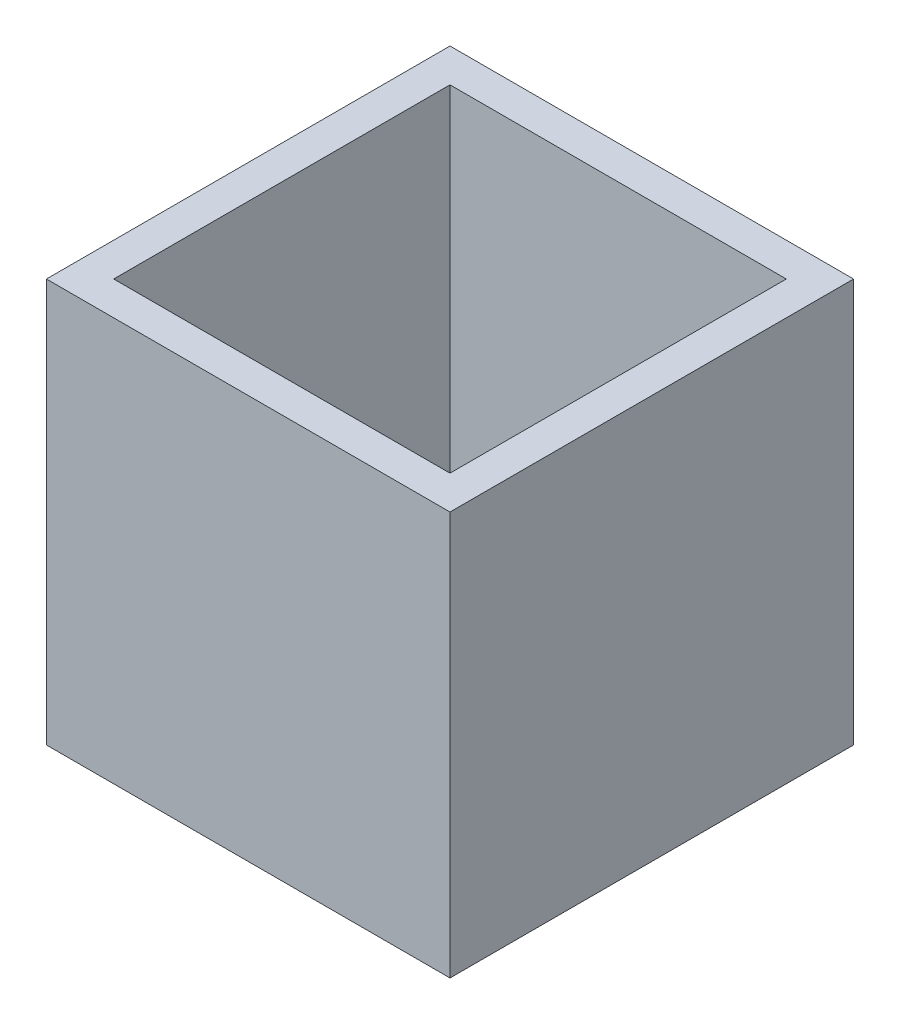
ISO-10303-21;
HEADER;
FILE_DESCRIPTION(('STEP AP214'),'2;1');
FILE_NAME('part.step','',(''),(''),'','','');
FILE_SCHEMA(('AUTOMOTIVE_DESIGN { 1 0 10303 214 1 1 1 1 }'));
ENDSEC;
DATA;
#1=APPLICATION_CONTEXT('core data for automotive mechanical design processes');
#2=APPLICATION_PROTOCOL_DEFINITION('international standard','automotive_design',2000,#1);
#3=PRODUCT_CONTEXT('',#1,'mechanical');
#4=PRODUCT('Part','Part','',(#3));
#5=PRODUCT_RELATED_PRODUCT_CATEGORY('part','',(#4));
#6=PRODUCT_DEFINITION_FORMATION('','',#4);
#7=PRODUCT_DEFINITION_CONTEXT('part definition',#1,'design');
#8=PRODUCT_DEFINITION('design','',#6,#7);
#9=PRODUCT_DEFINITION_SHAPE('','',#8);
#10=(LENGTH_UNIT() NAMED_UNIT(*) SI_UNIT(.MILLI.,.METRE.));
#11=(NAMED_UNIT(*) PLANE_ANGLE_UNIT() SI_UNIT($,.RADIAN.));
#12=(NAMED_UNIT(*) SI_UNIT($,.STERADIAN.) SOLID_ANGLE_UNIT());
#13=UNCERTAINTY_MEASURE_WITH_UNIT(LENGTH_MEASURE(1.E-05),#10,'distance_accuracy_value','');
#14=(GEOMETRIC_REPRESENTATION_CONTEXT(3) GLOBAL_UNCERTAINTY_ASSIGNED_CONTEXT((#13)) GLOBAL_UNIT_ASSIGNED_CONTEXT((#10,
#11,#12)) REPRESENTATION_CONTEXT('',''));
#15=CARTESIAN_POINT('',(0.,0.,0.));
#16=DIRECTION('',(0.,0.,1.));
#17=DIRECTION('',(1.,0.,0.));
#18=AXIS2_PLACEMENT_3D('',#15,#16,#17);
#19=CARTESIAN_POINT('',(150.,300.,-150.));
#20=DIRECTION('',(0.,-1.,0.));
#21=DIRECTION('',(0.,0.,-1.));
#22=AXIS2_PLACEMENT_3D('',#19,#20,#21);
#23=PLANE('',#22);
#24=DIRECTION('',(0.,0.,-1.));
#25=VECTOR('',#24,1.);
#26=CARTESIAN_POINT('',(150.,300.,150.));
#27=LINE('',#26,#25);
#28=CARTESIAN_POINT('',(150.,300.,150.));
#29=VERTEX_POINT('',#28);
#30=CARTESIAN_POINT('',(150.,300.,-150.));
#31=VERTEX_POINT('',#30);
#32=EDGE_CURVE('E142',#29,#31,#27,.T.);
#33=ORIENTED_EDGE('',*,*,#32,.T.);
#34=DIRECTION('',(-1.,0.,0.));
#35=VECTOR('',#34,1.);
#36=CARTESIAN_POINT('',(-150.,300.,-150.));
#37=LINE('',#36,#35);
#38=CARTESIAN_POINT('',(-150.,300.,-150.));
#39=VERTEX_POINT('',#38);
#40=EDGE_CURVE('E86',#31,#39,#37,.T.);
#41=ORIENTED_EDGE('',*,*,#40,.T.);
#42=DIRECTION('',(0.,0.,1.));
#43=VECTOR('',#42,1.);
#44=CARTESIAN_POINT('',(-150.,300.,150.));
#45=LINE('',#44,#43);
#46=CARTESIAN_POINT('',(-150.,300.,150.));
#47=VERTEX_POINT('',#46);
#48=EDGE_CURVE('E145',#39,#47,#45,.T.);
#49=ORIENTED_EDGE('',*,*,#48,.T.);
#50=DIRECTION('',(1.,0.,0.));
#51=VECTOR('',#50,1.);
#52=CARTESIAN_POINT('',(-150.,300.,150.));
#53=LINE('',#52,#51);
#54=EDGE_CURVE('E58',#47,#29,#53,.T.);
#55=ORIENTED_EDGE('',*,*,#54,.T.);
#56=EDGE_LOOP('',(#33,#41,#49,#55));
#57=FACE_BOUND('',#56,.T.);
#58=DIRECTION('',(0.,0.,-1.));
#59=VECTOR('',#58,1.);
#60=CARTESIAN_POINT('',(125.,300.,-150.));
#61=LINE('',#60,#59);
#62=CARTESIAN_POINT('',(125.,300.,125.));
#63=VERTEX_POINT('',#62);
#64=CARTESIAN_POINT('',(125.,300.,-125.));
#65=VERTEX_POINT('',#64);
#66=EDGE_CURVE('E131',#63,#65,#61,.T.);
#67=ORIENTED_EDGE('',*,*,#66,.F.);
#68=DIRECTION('',(1.,0.,0.));
#69=VECTOR('',#68,1.);
#70=CARTESIAN_POINT('',(150.,300.,125.));
#71=LINE('',#70,#69);
#72=CARTESIAN_POINT('',(-125.,300.,125.));
#73=VERTEX_POINT('',#72);
#74=EDGE_CURVE('E140',#73,#63,#71,.T.);
#75=ORIENTED_EDGE('',*,*,#74,.F.);
#76=DIRECTION('',(0.,0.,1.));
#77=VECTOR('',#76,1.);
#78=CARTESIAN_POINT('',(-125.,300.,-150.));
#79=LINE('',#78,#77);
#80=CARTESIAN_POINT('',(-125.,300.,-125.));
#81=VERTEX_POINT('',#80);
#82=EDGE_CURVE('E138',#81,#73,#79,.T.);
#83=ORIENTED_EDGE('',*,*,#82,.F.);
#84=DIRECTION('',(-1.,0.,0.));
#85=VECTOR('',#84,1.);
#86=CARTESIAN_POINT('',(150.,300.,-125.));
#87=LINE('',#86,#85);
#88=EDGE_CURVE('E123',#65,#81,#87,.T.);
#89=ORIENTED_EDGE('',*,*,#88,.F.);
#90=EDGE_LOOP('',(#67,#75,#83,#89));
#91=FACE_BOUND('',#90,.T.);
#92=ADVANCED_FACE('F34',(#57,#91),#23,.F.);
#93=CARTESIAN_POINT('',(150.,300.,150.));
#94=DIRECTION('',(-1.,0.,0.));
#95=DIRECTION('',(0.,0.,1.));
#96=AXIS2_PLACEMENT_3D('',#93,#94,#95);
#97=PLANE('',#96);
#98=DIRECTION('',(0.,0.,-1.));
#99=VECTOR('',#98,1.);
#100=CARTESIAN_POINT('',(150.,0.,150.));
#101=LINE('',#100,#99);
#102=CARTESIAN_POINT('',(150.,0.,150.));
#103=VERTEX_POINT('',#102);
#104=CARTESIAN_POINT('',(150.,0.,-150.));
#105=VERTEX_POINT('',#104);
#106=EDGE_CURVE('E149',#103,#105,#101,.T.);
#107=ORIENTED_EDGE('',*,*,#106,.T.);
#108=DIRECTION('',(0.,-1.,0.));
#109=VECTOR('',#108,1.);
#110=CARTESIAN_POINT('',(150.,300.,-150.));
#111=LINE('',#110,#109);
#112=EDGE_CURVE('E11',#31,#105,#111,.T.);
#113=ORIENTED_EDGE('',*,*,#112,.F.);
#114=ORIENTED_EDGE('',*,*,#32,.F.);
#115=DIRECTION('',(0.,-1.,0.));
#116=VECTOR('',#115,1.);
#117=CARTESIAN_POINT('',(150.,300.,150.));
#118=LINE('',#117,#116);
#119=EDGE_CURVE('E148',#29,#103,#118,.T.);
#120=ORIENTED_EDGE('',*,*,#119,.T.);
#121=EDGE_LOOP('',(#107,#113,#114,#120));
#122=FACE_BOUND('',#121,.T.);
#123=ADVANCED_FACE('F36',(#122),#97,.F.);
#124=CARTESIAN_POINT('',(-150.,300.,-150.));
#125=DIRECTION('',(0.,0.,1.));
#126=DIRECTION('',(1.,0.,0.));
#127=AXIS2_PLACEMENT_3D('',#124,#125,#126);
#128=PLANE('',#127);
#129=DIRECTION('',(-1.,0.,0.));
#130=VECTOR('',#129,1.);
#131=CARTESIAN_POINT('',(-150.,0.,-150.));
#132=LINE('',#131,#130);
#133=CARTESIAN_POINT('',(-150.,0.,-150.));
#134=VERTEX_POINT('',#133);
#135=EDGE_CURVE('E152',#105,#134,#132,.T.);
#136=ORIENTED_EDGE('',*,*,#135,.T.);
#137=DIRECTION('',(0.,-1.,0.));
#138=VECTOR('',#137,1.);
#139=CARTESIAN_POINT('',(-150.,300.,-150.));
#140=LINE('',#139,#138);
#141=EDGE_CURVE('E42',#39,#134,#140,.T.);
#142=ORIENTED_EDGE('',*,*,#141,.F.);
#143=ORIENTED_EDGE('',*,*,#40,.F.);
#144=ORIENTED_EDGE('',*,*,#112,.T.);
#145=EDGE_LOOP('',(#136,#142,#143,#144));
#146=FACE_BOUND('',#145,.T.);
#147=ADVANCED_FACE('F180',(#146),#128,.F.);
#148=CARTESIAN_POINT('',(-150.,300.,150.));
#149=DIRECTION('',(1.,0.,0.));
#150=DIRECTION('',(0.,0.,-1.));
#151=AXIS2_PLACEMENT_3D('',#148,#149,#150);
#152=PLANE('',#151);
#153=DIRECTION('',(0.,0.,1.));
#154=VECTOR('',#153,1.);
#155=CARTESIAN_POINT('',(-150.,0.,150.));
#156=LINE('',#155,#154);
#157=CARTESIAN_POINT('',(-150.,0.,150.));
#158=VERTEX_POINT('',#157);
#159=EDGE_CURVE('E154',#134,#158,#156,.T.);
#160=ORIENTED_EDGE('',*,*,#159,.T.);
#161=DIRECTION('',(0.,-1.,0.));
#162=VECTOR('',#161,1.);
#163=CARTESIAN_POINT('',(-150.,300.,150.));
#164=LINE('',#163,#162);
#165=EDGE_CURVE('E158',#47,#158,#164,.T.);
#166=ORIENTED_EDGE('',*,*,#165,.F.);
#167=ORIENTED_EDGE('',*,*,#48,.F.);
#168=ORIENTED_EDGE('',*,*,#141,.T.);
#169=EDGE_LOOP('',(#160,#166,#167,#168));
#170=FACE_BOUND('',#169,.T.);
#171=ADVANCED_FACE('F163',(#170),#152,.F.);
#172=CARTESIAN_POINT('',(-150.,300.,150.));
#173=DIRECTION('',(0.,0.,-1.));
#174=DIRECTION('',(-1.,0.,0.));
#175=AXIS2_PLACEMENT_3D('',#172,#173,#174);
#176=PLANE('',#175);
#177=DIRECTION('',(1.,0.,0.));
#178=VECTOR('',#177,1.);
#179=CARTESIAN_POINT('',(-150.,0.,150.));
#180=LINE('',#179,#178);
#181=EDGE_CURVE('E79',#158,#103,#180,.T.);
#182=ORIENTED_EDGE('',*,*,#181,.T.);
#183=ORIENTED_EDGE('',*,*,#119,.F.);
#184=ORIENTED_EDGE('',*,*,#54,.F.);
#185=ORIENTED_EDGE('',*,*,#165,.T.);
#186=EDGE_LOOP('',(#182,#183,#184,#185));
#187=FACE_BOUND('',#186,.T.);
#188=ADVANCED_FACE('F171',(#187),#176,.F.);
#189=CARTESIAN_POINT('',(150.,0.,-150.));
#190=DIRECTION('',(0.,-1.,0.));
#191=DIRECTION('',(0.,0.,-1.));
#192=AXIS2_PLACEMENT_3D('',#189,#190,#191);
#193=PLANE('',#192);
#194=ORIENTED_EDGE('',*,*,#106,.F.);
#195=ORIENTED_EDGE('',*,*,#181,.F.);
#196=ORIENTED_EDGE('',*,*,#159,.F.);
#197=ORIENTED_EDGE('',*,*,#135,.F.);
#198=EDGE_LOOP('',(#194,#195,#196,#197));
#199=FACE_BOUND('',#198,.T.);
#200=ADVANCED_FACE('F167',(#199),#193,.T.);
#201=CARTESIAN_POINT('',(125.,300.,150.));
#202=DIRECTION('',(-1.,0.,0.));
#203=DIRECTION('',(0.,0.,1.));
#204=AXIS2_PLACEMENT_3D('',#201,#202,#203);
#205=PLANE('',#204);
#206=DIRECTION('',(0.,0.,-1.));
#207=VECTOR('',#206,1.);
#208=CARTESIAN_POINT('',(125.,25.,-150.));
#209=LINE('',#208,#207);
#210=CARTESIAN_POINT('',(125.,25.,125.));
#211=VERTEX_POINT('',#210);
#212=CARTESIAN_POINT('',(125.,25.,-125.));
#213=VERTEX_POINT('',#212);
#214=EDGE_CURVE('E114',#211,#213,#209,.T.);
#215=ORIENTED_EDGE('',*,*,#214,.F.);
#216=DIRECTION('',(0.,-1.,0.));
#217=VECTOR('',#216,1.);
#218=CARTESIAN_POINT('',(125.,300.,125.));
#219=LINE('',#218,#217);
#220=EDGE_CURVE('E134',#63,#211,#219,.T.);
#221=ORIENTED_EDGE('',*,*,#220,.F.);
#222=ORIENTED_EDGE('',*,*,#66,.T.);
#223=DIRECTION('',(0.,-1.,0.));
#224=VECTOR('',#223,1.);
#225=CARTESIAN_POINT('',(125.,300.,-125.));
#226=LINE('',#225,#224);
#227=EDGE_CURVE('E126',#65,#213,#226,.T.);
#228=ORIENTED_EDGE('',*,*,#227,.T.);
#229=EDGE_LOOP('',(#215,#221,#222,#228));
#230=FACE_BOUND('',#229,.T.);
#231=ADVANCED_FACE('F178',(#230),#205,.T.);
#232=CARTESIAN_POINT('',(-150.,300.,-125.));
#233=DIRECTION('',(0.,0.,1.));
#234=DIRECTION('',(1.,0.,0.));
#235=AXIS2_PLACEMENT_3D('',#232,#233,#234);
#236=PLANE('',#235);
#237=DIRECTION('',(-1.,0.,0.));
#238=VECTOR('',#237,1.);
#239=CARTESIAN_POINT('',(150.,25.,-125.));
#240=LINE('',#239,#238);
#241=CARTESIAN_POINT('',(-125.,25.,-125.));
#242=VERTEX_POINT('',#241);
#243=EDGE_CURVE('E108',#213,#242,#240,.T.);
#244=ORIENTED_EDGE('',*,*,#243,.F.);
#245=ORIENTED_EDGE('',*,*,#227,.F.);
#246=ORIENTED_EDGE('',*,*,#88,.T.);
#247=DIRECTION('',(0.,-1.,0.));
#248=VECTOR('',#247,1.);
#249=CARTESIAN_POINT('',(-125.,300.,-125.));
#250=LINE('',#249,#248);
#251=EDGE_CURVE('E120',#81,#242,#250,.T.);
#252=ORIENTED_EDGE('',*,*,#251,.T.);
#253=EDGE_LOOP('',(#244,#245,#246,#252));
#254=FACE_BOUND('',#253,.T.);
#255=ADVANCED_FACE('F121',(#254),#236,.T.);
#256=CARTESIAN_POINT('',(-125.,300.,150.));
#257=DIRECTION('',(1.,0.,0.));
#258=DIRECTION('',(0.,0.,-1.));
#259=AXIS2_PLACEMENT_3D('',#256,#257,#258);
#260=PLANE('',#259);
#261=DIRECTION('',(0.,0.,1.));
#262=VECTOR('',#261,1.);
#263=CARTESIAN_POINT('',(-125.,25.,-150.));
#264=LINE('',#263,#262);
#265=CARTESIAN_POINT('',(-125.,25.,125.));
#266=VERTEX_POINT('',#265);
#267=EDGE_CURVE('E112',#242,#266,#264,.T.);
#268=ORIENTED_EDGE('',*,*,#267,.F.);
#269=ORIENTED_EDGE('',*,*,#251,.F.);
#270=ORIENTED_EDGE('',*,*,#82,.T.);
#271=DIRECTION('',(0.,-1.,0.));
#272=VECTOR('',#271,1.);
#273=CARTESIAN_POINT('',(-125.,300.,125.));
#274=LINE('',#273,#272);
#275=EDGE_CURVE('E49',#73,#266,#274,.T.);
#276=ORIENTED_EDGE('',*,*,#275,.T.);
#277=EDGE_LOOP('',(#268,#269,#270,#276));
#278=FACE_BOUND('',#277,.T.);
#279=ADVANCED_FACE('F128',(#278),#260,.T.);
#280=CARTESIAN_POINT('',(-150.,300.,125.));
#281=DIRECTION('',(0.,0.,-1.));
#282=DIRECTION('',(-1.,0.,0.));
#283=AXIS2_PLACEMENT_3D('',#280,#281,#282);
#284=PLANE('',#283);
#285=DIRECTION('',(1.,0.,0.));
#286=VECTOR('',#285,1.);
#287=CARTESIAN_POINT('',(150.,25.,125.));
#288=LINE('',#287,#286);
#289=EDGE_CURVE('E129',#266,#211,#288,.T.);
#290=ORIENTED_EDGE('',*,*,#289,.F.);
#291=ORIENTED_EDGE('',*,*,#275,.F.);
#292=ORIENTED_EDGE('',*,*,#74,.T.);
#293=ORIENTED_EDGE('',*,*,#220,.T.);
#294=EDGE_LOOP('',(#290,#291,#292,#293));
#295=FACE_BOUND('',#294,.T.);
#296=ADVANCED_FACE('F191',(#295),#284,.T.);
#297=CARTESIAN_POINT('',(150.,25.,-150.));
#298=DIRECTION('',(0.,-1.,0.));
#299=DIRECTION('',(0.,0.,-1.));
#300=AXIS2_PLACEMENT_3D('',#297,#298,#299);
#301=PLANE('',#300);
#302=ORIENTED_EDGE('',*,*,#214,.T.);
#303=ORIENTED_EDGE('',*,*,#243,.T.);
#304=ORIENTED_EDGE('',*,*,#267,.T.);
#305=ORIENTED_EDGE('',*,*,#289,.T.);
#306=EDGE_LOOP('',(#302,#303,#304,#305));
#307=FACE_BOUND('',#306,.T.);
#308=ADVANCED_FACE('F110',(#307),#301,.F.);
#309=CLOSED_SHELL('',(#92,#123,#147,#171,#188,#200,#231,#255,#279,#296,#308));
#310=MANIFOLD_SOLID_BREP('B2',#309);
#311=ADVANCED_BREP_SHAPE_REPRESENTATION('',(#18,#310),#14);
#312=SHAPE_DEFINITION_REPRESENTATION(#9,#311);
ENDSEC;
END-ISO-10303-21;
